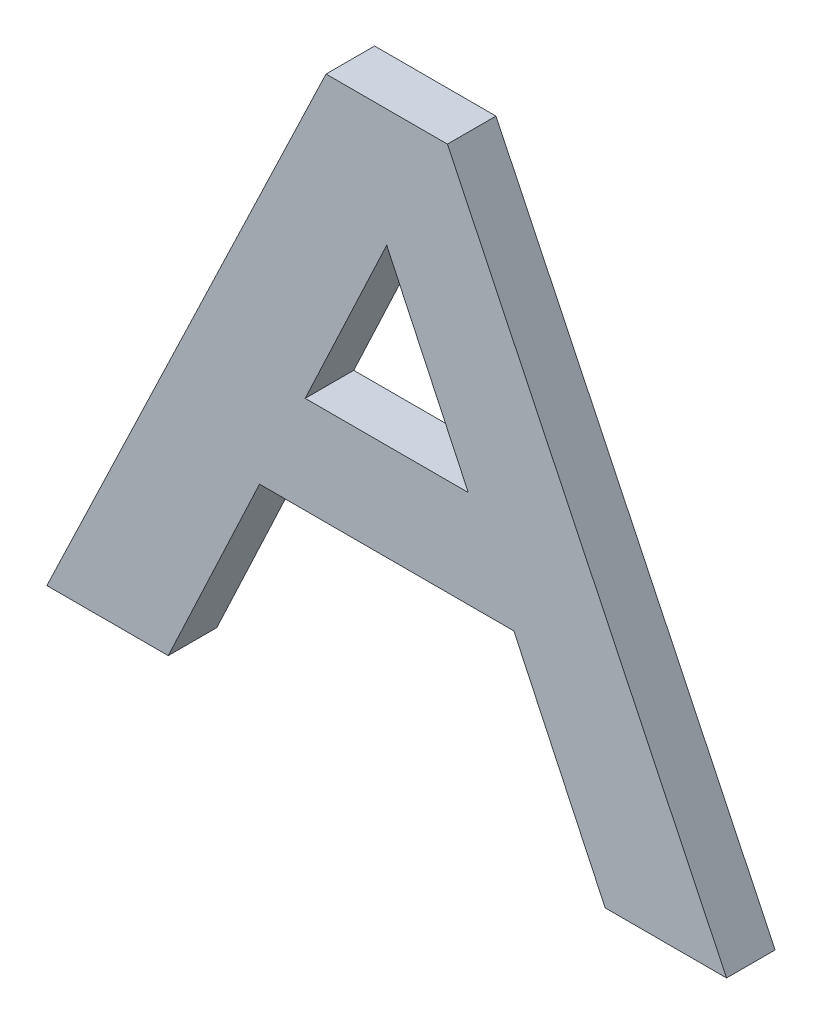
ISO-10303-21;
HEADER;
FILE_DESCRIPTION(('STEP AP214'),'2;1');
FILE_NAME('part.step','',(''),(''),'','','');
FILE_SCHEMA(('AUTOMOTIVE_DESIGN { 1 0 10303 214 1 1 1 1 }'));
ENDSEC;
DATA;
#1=APPLICATION_CONTEXT('core data for automotive mechanical design processes');
#2=APPLICATION_PROTOCOL_DEFINITION('international standard','automotive_design',2000,#1);
#3=PRODUCT_CONTEXT('',#1,'mechanical');
#4=PRODUCT('Part','Part','',(#3));
#5=PRODUCT_RELATED_PRODUCT_CATEGORY('part','',(#4));
#6=PRODUCT_DEFINITION_FORMATION('','',#4);
#7=PRODUCT_DEFINITION_CONTEXT('part definition',#1,'design');
#8=PRODUCT_DEFINITION('design','',#6,#7);
#9=PRODUCT_DEFINITION_SHAPE('','',#8);
#10=(LENGTH_UNIT() NAMED_UNIT(*) SI_UNIT(.MILLI.,.METRE.));
#11=(NAMED_UNIT(*) PLANE_ANGLE_UNIT() SI_UNIT($,.RADIAN.));
#12=(NAMED_UNIT(*) SI_UNIT($,.STERADIAN.) SOLID_ANGLE_UNIT());
#13=UNCERTAINTY_MEASURE_WITH_UNIT(LENGTH_MEASURE(1.E-05),#10,'distance_accuracy_value','');
#14=(GEOMETRIC_REPRESENTATION_CONTEXT(3) GLOBAL_UNCERTAINTY_ASSIGNED_CONTEXT((#13)) GLOBAL_UNIT_ASSIGNED_CONTEXT((#10,
#11,#12)) REPRESENTATION_CONTEXT('',''));
#15=CARTESIAN_POINT('',(0.,0.,0.));
#16=DIRECTION('',(0.,0.,1.));
#17=DIRECTION('',(1.,0.,0.));
#18=AXIS2_PLACEMENT_3D('',#15,#16,#17);
#19=CARTESIAN_POINT('',(36.1499470525944,17.3218496293682,6.35));
#20=DIRECTION('',(0.901816028724632,0.432120180430554,0.));
#21=DIRECTION('',(-0.432120180430554,0.901816028724632,0.));
#22=AXIS2_PLACEMENT_3D('',#19,#20,#21);
#23=PLANE('',#22);
#24=DIRECTION('',(0.432120180430554,-0.901816028724632,0.));
#25=VECTOR('',#24,1.);
#26=CARTESIAN_POINT('',(36.1499470525944,17.3218496293682,0.));
#27=LINE('',#26,#25);
#28=CARTESIAN_POINT('',(7.9375,76.1999999999999,0.));
#29=VERTEX_POINT('',#28);
#30=CARTESIAN_POINT('',(44.45,0.,0.));
#31=VERTEX_POINT('',#30);
#32=EDGE_CURVE('E166',#29,#31,#27,.T.);
#33=ORIENTED_EDGE('',*,*,#32,.F.);
#34=DIRECTION('',(0.,0.,-1.));
#35=VECTOR('',#34,1.);
#36=CARTESIAN_POINT('',(7.9375,76.1999999999999,6.35));
#37=LINE('',#36,#35);
#38=CARTESIAN_POINT('',(7.9375,76.1999999999999,6.35));
#39=VERTEX_POINT('',#38);
#40=EDGE_CURVE('E11',#39,#29,#37,.T.);
#41=ORIENTED_EDGE('',*,*,#40,.F.);
#42=DIRECTION('',(0.432120180430554,-0.901816028724632,0.));
#43=VECTOR('',#42,1.);
#44=CARTESIAN_POINT('',(36.1499470525944,17.3218496293682,6.35));
#45=LINE('',#44,#43);
#46=CARTESIAN_POINT('',(44.45,0.,6.35));
#47=VERTEX_POINT('',#46);
#48=EDGE_CURVE('E218',#39,#47,#45,.T.);
#49=ORIENTED_EDGE('',*,*,#48,.T.);
#50=DIRECTION('',(0.,0.,-1.));
#51=VECTOR('',#50,1.);
#52=CARTESIAN_POINT('',(44.45,0.,6.35));
#53=LINE('',#52,#51);
#54=EDGE_CURVE('E58',#47,#31,#53,.T.);
#55=ORIENTED_EDGE('',*,*,#54,.T.);
#56=EDGE_LOOP('',(#33,#41,#49,#55));
#57=FACE_BOUND('',#56,.T.);
#58=ADVANCED_FACE('F39',(#57),#23,.T.);
#59=CARTESIAN_POINT('',(0.,76.1999999999999,6.35));
#60=DIRECTION('',(0.,1.,0.));
#61=DIRECTION('',(0.,0.,1.));
#62=AXIS2_PLACEMENT_3D('',#59,#60,#61);
#63=PLANE('',#62);
#64=DIRECTION('',(1.,0.,0.));
#65=VECTOR('',#64,1.);
#66=CARTESIAN_POINT('',(0.,76.1999999999999,0.));
#67=LINE('',#66,#65);
#68=CARTESIAN_POINT('',(-7.9375,76.1999999999999,0.));
#69=VERTEX_POINT('',#68);
#70=EDGE_CURVE('E168',#69,#29,#67,.T.);
#71=ORIENTED_EDGE('',*,*,#70,.F.);
#72=DIRECTION('',(0.,0.,-1.));
#73=VECTOR('',#72,1.);
#74=CARTESIAN_POINT('',(-7.9375,76.1999999999999,6.35));
#75=LINE('',#74,#73);
#76=CARTESIAN_POINT('',(-7.9375,76.1999999999999,6.35));
#77=VERTEX_POINT('',#76);
#78=EDGE_CURVE('E49',#77,#69,#75,.T.);
#79=ORIENTED_EDGE('',*,*,#78,.F.);
#80=DIRECTION('',(1.,0.,0.));
#81=VECTOR('',#80,1.);
#82=CARTESIAN_POINT('',(0.,76.1999999999999,6.35));
#83=LINE('',#82,#81);
#84=EDGE_CURVE('E220',#77,#39,#83,.T.);
#85=ORIENTED_EDGE('',*,*,#84,.T.);
#86=ORIENTED_EDGE('',*,*,#40,.T.);
#87=EDGE_LOOP('',(#71,#79,#85,#86));
#88=FACE_BOUND('',#87,.T.);
#89=ADVANCED_FACE('F248',(#88),#63,.T.);
#90=CARTESIAN_POINT('',(-36.1499470525944,17.3218496293682,6.35));
#91=DIRECTION('',(0.901816028724632,-0.432120180430554,0.));
#92=DIRECTION('',(0.432120180430554,0.901816028724632,0.));
#93=AXIS2_PLACEMENT_3D('',#90,#91,#92);
#94=PLANE('',#93);
#95=DIRECTION('',(-0.432120180430554,-0.901816028724632,0.));
#96=VECTOR('',#95,1.);
#97=CARTESIAN_POINT('',(-36.1499470525944,17.3218496293682,0.));
#98=LINE('',#97,#96);
#99=CARTESIAN_POINT('',(-44.45,0.,0.));
#100=VERTEX_POINT('',#99);
#101=EDGE_CURVE('E171',#69,#100,#98,.T.);
#102=ORIENTED_EDGE('',*,*,#101,.T.);
#103=DIRECTION('',(0.,0.,-1.));
#104=VECTOR('',#103,1.);
#105=CARTESIAN_POINT('',(-44.45,0.,6.35));
#106=LINE('',#105,#104);
#107=CARTESIAN_POINT('',(-44.45,0.,6.35));
#108=VERTEX_POINT('',#107);
#109=EDGE_CURVE('E192',#108,#100,#106,.T.);
#110=ORIENTED_EDGE('',*,*,#109,.F.);
#111=DIRECTION('',(-0.432120180430554,-0.901816028724632,0.));
#112=VECTOR('',#111,1.);
#113=CARTESIAN_POINT('',(-36.1499470525944,17.3218496293682,6.35));
#114=LINE('',#113,#112);
#115=EDGE_CURVE('E223',#77,#108,#114,.T.);
#116=ORIENTED_EDGE('',*,*,#115,.F.);
#117=ORIENTED_EDGE('',*,*,#78,.T.);
#118=EDGE_LOOP('',(#102,#110,#116,#117));
#119=FACE_BOUND('',#118,.T.);
#120=ADVANCED_FACE('F253',(#119),#94,.F.);
#121=CARTESIAN_POINT('',(0.,0.,6.35));
#122=DIRECTION('',(0.,1.,0.));
#123=DIRECTION('',(-1.,0.,0.));
#124=AXIS2_PLACEMENT_3D('',#121,#122,#123);
#125=PLANE('',#124);
#126=DIRECTION('',(1.,0.,0.));
#127=VECTOR('',#126,1.);
#128=CARTESIAN_POINT('',(0.,0.,0.));
#129=LINE('',#128,#127);
#130=CARTESIAN_POINT('',(-28.575,0.,0.));
#131=VERTEX_POINT('',#130);
#132=EDGE_CURVE('E174',#100,#131,#129,.T.);
#133=ORIENTED_EDGE('',*,*,#132,.T.);
#134=DIRECTION('',(0.,0.,-1.));
#135=VECTOR('',#134,1.);
#136=CARTESIAN_POINT('',(-28.575,0.,6.35));
#137=LINE('',#136,#135);
#138=CARTESIAN_POINT('',(-28.575,0.,6.35));
#139=VERTEX_POINT('',#138);
#140=EDGE_CURVE('E189',#139,#131,#137,.T.);
#141=ORIENTED_EDGE('',*,*,#140,.F.);
#142=DIRECTION('',(1.,0.,0.));
#143=VECTOR('',#142,1.);
#144=CARTESIAN_POINT('',(0.,0.,6.35));
#145=LINE('',#144,#143);
#146=EDGE_CURVE('E226',#108,#139,#145,.T.);
#147=ORIENTED_EDGE('',*,*,#146,.F.);
#148=ORIENTED_EDGE('',*,*,#109,.T.);
#149=EDGE_LOOP('',(#133,#141,#147,#148));
#150=FACE_BOUND('',#149,.T.);
#151=ADVANCED_FACE('F232',(#150),#125,.F.);
#152=CARTESIAN_POINT('',(-23.4031398800721,11.0017164945675,6.35));
#153=DIRECTION('',(-0.904990342413962,0.425432109904106,0.));
#154=DIRECTION('',(-0.425432109904106,-0.904990342413962,0.));
#155=AXIS2_PLACEMENT_3D('',#152,#153,#154);
#156=PLANE('',#155);
#157=DIRECTION('',(0.425432109904106,0.904990342413962,0.));
#158=VECTOR('',#157,1.);
#159=CARTESIAN_POINT('',(-23.4031398800721,11.0017164945675,0.));
#160=LINE('',#159,#158);
#161=CARTESIAN_POINT('',(-16.6345680582176,25.3999999999999,0.));
#162=VERTEX_POINT('',#161);
#163=EDGE_CURVE('E177',#131,#162,#160,.T.);
#164=ORIENTED_EDGE('',*,*,#163,.T.);
#165=DIRECTION('',(0.,0.,-1.));
#166=VECTOR('',#165,1.);
#167=CARTESIAN_POINT('',(-16.6345680582176,25.3999999999999,6.35));
#168=LINE('',#167,#166);
#169=CARTESIAN_POINT('',(-16.6345680582176,25.3999999999999,6.35));
#170=VERTEX_POINT('',#169);
#171=EDGE_CURVE('E149',#170,#162,#168,.T.);
#172=ORIENTED_EDGE('',*,*,#171,.F.);
#173=DIRECTION('',(0.425432109904106,0.904990342413962,0.));
#174=VECTOR('',#173,1.);
#175=CARTESIAN_POINT('',(-23.4031398800721,11.0017164945675,6.35));
#176=LINE('',#175,#174);
#177=EDGE_CURVE('E138',#139,#170,#176,.T.);
#178=ORIENTED_EDGE('',*,*,#177,.F.);
#179=ORIENTED_EDGE('',*,*,#140,.T.);
#180=EDGE_LOOP('',(#164,#172,#178,#179));
#181=FACE_BOUND('',#180,.T.);
#182=ADVANCED_FACE('F234',(#181),#156,.F.);
#183=CARTESIAN_POINT('',(0.,25.3999999999999,6.35));
#184=DIRECTION('',(0.,1.,0.));
#185=DIRECTION('',(0.,0.,1.));
#186=AXIS2_PLACEMENT_3D('',#183,#184,#185);
#187=PLANE('',#186);
#188=DIRECTION('',(1.,0.,0.));
#189=VECTOR('',#188,1.);
#190=CARTESIAN_POINT('',(0.,25.3999999999999,0.));
#191=LINE('',#190,#189);
#192=CARTESIAN_POINT('',(16.6345680582176,25.3999999999999,0.));
#193=VERTEX_POINT('',#192);
#194=EDGE_CURVE('E146',#162,#193,#191,.T.);
#195=ORIENTED_EDGE('',*,*,#194,.T.);
#196=DIRECTION('',(0.,0.,-1.));
#197=VECTOR('',#196,1.);
#198=CARTESIAN_POINT('',(16.6345680582176,25.3999999999999,6.35));
#199=LINE('',#198,#197);
#200=CARTESIAN_POINT('',(16.6345680582176,25.3999999999999,6.35));
#201=VERTEX_POINT('',#200);
#202=EDGE_CURVE('E144',#201,#193,#199,.T.);
#203=ORIENTED_EDGE('',*,*,#202,.F.);
#204=DIRECTION('',(1.,0.,0.));
#205=VECTOR('',#204,1.);
#206=CARTESIAN_POINT('',(0.,25.3999999999999,6.35));
#207=LINE('',#206,#205);
#208=EDGE_CURVE('E130',#170,#201,#207,.T.);
#209=ORIENTED_EDGE('',*,*,#208,.F.);
#210=ORIENTED_EDGE('',*,*,#171,.T.);
#211=EDGE_LOOP('',(#195,#203,#209,#210));
#212=FACE_BOUND('',#211,.T.);
#213=ADVANCED_FACE('F145',(#212),#187,.F.);
#214=CARTESIAN_POINT('',(23.4031398800721,11.0017164945675,6.35));
#215=DIRECTION('',(-0.904990342413962,-0.425432109904106,0.));
#216=DIRECTION('',(0.425432109904106,-0.904990342413962,0.));
#217=AXIS2_PLACEMENT_3D('',#214,#215,#216);
#218=PLANE('',#217);
#219=DIRECTION('',(-0.425432109904106,0.904990342413962,0.));
#220=VECTOR('',#219,1.);
#221=CARTESIAN_POINT('',(23.4031398800721,11.0017164945675,0.));
#222=LINE('',#221,#220);
#223=CARTESIAN_POINT('',(28.575,0.,0.));
#224=VERTEX_POINT('',#223);
#225=EDGE_CURVE('E181',#224,#193,#222,.T.);
#226=ORIENTED_EDGE('',*,*,#225,.F.);
#227=DIRECTION('',(0.,0.,-1.));
#228=VECTOR('',#227,1.);
#229=CARTESIAN_POINT('',(28.575,0.,6.35));
#230=LINE('',#229,#228);
#231=CARTESIAN_POINT('',(28.575,0.,6.35));
#232=VERTEX_POINT('',#231);
#233=EDGE_CURVE('E92',#232,#224,#230,.T.);
#234=ORIENTED_EDGE('',*,*,#233,.F.);
#235=DIRECTION('',(-0.425432109904106,0.904990342413962,0.));
#236=VECTOR('',#235,1.);
#237=CARTESIAN_POINT('',(23.4031398800721,11.0017164945675,6.35));
#238=LINE('',#237,#236);
#239=EDGE_CURVE('E136',#232,#201,#238,.T.);
#240=ORIENTED_EDGE('',*,*,#239,.T.);
#241=ORIENTED_EDGE('',*,*,#202,.T.);
#242=EDGE_LOOP('',(#226,#234,#240,#241));
#243=FACE_BOUND('',#242,.T.);
#244=ADVANCED_FACE('F151',(#243),#218,.T.);
#245=CARTESIAN_POINT('',(-23.4031398800721,11.0017164945675,6.35));
#246=DIRECTION('',(-0.904990342413962,0.425432109904106,0.));
#247=DIRECTION('',(-0.425432109904106,-0.904990342413962,0.));
#248=AXIS2_PLACEMENT_3D('',#245,#246,#247);
#249=PLANE('',#248);
#250=DIRECTION('',(0.425432109904106,0.904990342413962,0.));
#251=VECTOR('',#250,1.);
#252=CARTESIAN_POINT('',(-23.4031398800721,11.0017164945675,0.));
#253=LINE('',#252,#251);
#254=CARTESIAN_POINT('',(-10.6643520873264,38.0999999999999,0.));
#255=VERTEX_POINT('',#254);
#256=CARTESIAN_POINT('',(0.,60.7854894646009,0.));
#257=VERTEX_POINT('',#256);
#258=EDGE_CURVE('E158',#255,#257,#253,.T.);
#259=ORIENTED_EDGE('',*,*,#258,.T.);
#260=DIRECTION('',(0.,0.,-1.));
#261=VECTOR('',#260,1.);
#262=CARTESIAN_POINT('',(0.,60.7854894646009,6.35));
#263=LINE('',#262,#261);
#264=CARTESIAN_POINT('',(0.,60.7854894646009,6.35));
#265=VERTEX_POINT('',#264);
#266=EDGE_CURVE('E43',#265,#257,#263,.T.);
#267=ORIENTED_EDGE('',*,*,#266,.F.);
#268=DIRECTION('',(0.425432109904106,0.904990342413962,0.));
#269=VECTOR('',#268,1.);
#270=CARTESIAN_POINT('',(-23.4031398800721,11.0017164945675,6.35));
#271=LINE('',#270,#269);
#272=CARTESIAN_POINT('',(-10.6643520873264,38.0999999999999,6.35));
#273=VERTEX_POINT('',#272);
#274=EDGE_CURVE('E105',#273,#265,#271,.T.);
#275=ORIENTED_EDGE('',*,*,#274,.F.);
#276=DIRECTION('',(0.,0.,-1.));
#277=VECTOR('',#276,1.);
#278=CARTESIAN_POINT('',(-10.6643520873264,38.0999999999999,6.35));
#279=LINE('',#278,#277);
#280=EDGE_CURVE('E154',#273,#255,#279,.T.);
#281=ORIENTED_EDGE('',*,*,#280,.T.);
#282=EDGE_LOOP('',(#259,#267,#275,#281));
#283=FACE_BOUND('',#282,.T.);
#284=ADVANCED_FACE('F41',(#283),#249,.F.);
#285=CARTESIAN_POINT('',(23.4031398800721,11.0017164945675,6.35));
#286=DIRECTION('',(-0.904990342413962,-0.425432109904106,0.));
#287=DIRECTION('',(0.425432109904106,-0.904990342413962,0.));
#288=AXIS2_PLACEMENT_3D('',#285,#286,#287);
#289=PLANE('',#288);
#290=DIRECTION('',(-0.425432109904106,0.904990342413962,0.));
#291=VECTOR('',#290,1.);
#292=CARTESIAN_POINT('',(23.4031398800721,11.0017164945675,0.));
#293=LINE('',#292,#291);
#294=CARTESIAN_POINT('',(10.6643520873264,38.0999999999999,0.));
#295=VERTEX_POINT('',#294);
#296=EDGE_CURVE('E161',#295,#257,#293,.T.);
#297=ORIENTED_EDGE('',*,*,#296,.F.);
#298=DIRECTION('',(0.,0.,-1.));
#299=VECTOR('',#298,1.);
#300=CARTESIAN_POINT('',(10.6643520873264,38.0999999999999,6.35));
#301=LINE('',#300,#299);
#302=CARTESIAN_POINT('',(10.6643520873264,38.0999999999999,6.35));
#303=VERTEX_POINT('',#302);
#304=EDGE_CURVE('E197',#303,#295,#301,.T.);
#305=ORIENTED_EDGE('',*,*,#304,.F.);
#306=DIRECTION('',(-0.425432109904106,0.904990342413962,0.));
#307=VECTOR('',#306,1.);
#308=CARTESIAN_POINT('',(23.4031398800721,11.0017164945675,6.35));
#309=LINE('',#308,#307);
#310=EDGE_CURVE('E205',#303,#265,#309,.T.);
#311=ORIENTED_EDGE('',*,*,#310,.T.);
#312=ORIENTED_EDGE('',*,*,#266,.T.);
#313=EDGE_LOOP('',(#297,#305,#311,#312));
#314=FACE_BOUND('',#313,.T.);
#315=ADVANCED_FACE('F204',(#314),#289,.T.);
#316=CARTESIAN_POINT('',(0.,38.0999999999999,6.35));
#317=DIRECTION('',(0.,-1.,0.));
#318=DIRECTION('',(0.,0.,-1.));
#319=AXIS2_PLACEMENT_3D('',#316,#317,#318);
#320=PLANE('',#319);
#321=DIRECTION('',(-1.,0.,0.));
#322=VECTOR('',#321,1.);
#323=CARTESIAN_POINT('',(0.,38.0999999999999,0.));
#324=LINE('',#323,#322);
#325=EDGE_CURVE('E164',#295,#255,#324,.T.);
#326=ORIENTED_EDGE('',*,*,#325,.T.);
#327=ORIENTED_EDGE('',*,*,#280,.F.);
#328=DIRECTION('',(-1.,0.,0.));
#329=VECTOR('',#328,1.);
#330=CARTESIAN_POINT('',(0.,38.0999999999999,6.35));
#331=LINE('',#330,#329);
#332=EDGE_CURVE('E213',#303,#273,#331,.T.);
#333=ORIENTED_EDGE('',*,*,#332,.F.);
#334=ORIENTED_EDGE('',*,*,#304,.T.);
#335=EDGE_LOOP('',(#326,#327,#333,#334));
#336=FACE_BOUND('',#335,.T.);
#337=ADVANCED_FACE('F212',(#336),#320,.F.);
#338=CARTESIAN_POINT('',(0.,0.,6.35));
#339=DIRECTION('',(0.,-1.,0.));
#340=DIRECTION('',(1.,0.,0.));
#341=AXIS2_PLACEMENT_3D('',#338,#339,#340);
#342=PLANE('',#341);
#343=DIRECTION('',(-1.,0.,0.));
#344=VECTOR('',#343,1.);
#345=CARTESIAN_POINT('',(0.,0.,0.));
#346=LINE('',#345,#344);
#347=EDGE_CURVE('E183',#31,#224,#346,.T.);
#348=ORIENTED_EDGE('',*,*,#347,.F.);
#349=ORIENTED_EDGE('',*,*,#54,.F.);
#350=DIRECTION('',(-1.,0.,0.));
#351=VECTOR('',#350,1.);
#352=CARTESIAN_POINT('',(0.,0.,6.35));
#353=LINE('',#352,#351);
#354=EDGE_CURVE('E152',#47,#232,#353,.T.);
#355=ORIENTED_EDGE('',*,*,#354,.T.);
#356=ORIENTED_EDGE('',*,*,#233,.T.);
#357=EDGE_LOOP('',(#348,#349,#355,#356));
#358=FACE_BOUND('',#357,.T.);
#359=ADVANCED_FACE('F236',(#358),#342,.T.);
#360=CARTESIAN_POINT('',(0.,0.,6.35));
#361=DIRECTION('',(0.,0.,1.));
#362=DIRECTION('',(1.,0.,0.));
#363=AXIS2_PLACEMENT_3D('',#360,#361,#362);
#364=PLANE('',#363);
#365=ORIENTED_EDGE('',*,*,#274,.T.);
#366=ORIENTED_EDGE('',*,*,#310,.F.);
#367=ORIENTED_EDGE('',*,*,#332,.T.);
#368=EDGE_LOOP('',(#365,#366,#367));
#369=FACE_BOUND('',#368,.T.);
#370=ORIENTED_EDGE('',*,*,#48,.F.);
#371=ORIENTED_EDGE('',*,*,#84,.F.);
#372=ORIENTED_EDGE('',*,*,#115,.T.);
#373=ORIENTED_EDGE('',*,*,#146,.T.);
#374=ORIENTED_EDGE('',*,*,#177,.T.);
#375=ORIENTED_EDGE('',*,*,#208,.T.);
#376=ORIENTED_EDGE('',*,*,#239,.F.);
#377=ORIENTED_EDGE('',*,*,#354,.F.);
#378=EDGE_LOOP('',(#370,#371,#372,#373,#374,#375,#376,#377));
#379=FACE_BOUND('',#378,.T.);
#380=ADVANCED_FACE('F133',(#369,#379),#364,.T.);
#381=CARTESIAN_POINT('',(0.,0.,0.));
#382=DIRECTION('',(0.,0.,1.));
#383=DIRECTION('',(1.,0.,0.));
#384=AXIS2_PLACEMENT_3D('',#381,#382,#383);
#385=PLANE('',#384);
#386=ORIENTED_EDGE('',*,*,#258,.F.);
#387=ORIENTED_EDGE('',*,*,#325,.F.);
#388=ORIENTED_EDGE('',*,*,#296,.T.);
#389=EDGE_LOOP('',(#386,#387,#388));
#390=FACE_BOUND('',#389,.T.);
#391=ORIENTED_EDGE('',*,*,#32,.T.);
#392=ORIENTED_EDGE('',*,*,#347,.T.);
#393=ORIENTED_EDGE('',*,*,#225,.T.);
#394=ORIENTED_EDGE('',*,*,#194,.F.);
#395=ORIENTED_EDGE('',*,*,#163,.F.);
#396=ORIENTED_EDGE('',*,*,#132,.F.);
#397=ORIENTED_EDGE('',*,*,#101,.F.);
#398=ORIENTED_EDGE('',*,*,#70,.T.);
#399=EDGE_LOOP('',(#391,#392,#393,#394,#395,#396,#397,#398));
#400=FACE_BOUND('',#399,.T.);
#401=ADVANCED_FACE('F210',(#390,#400),#385,.F.);
#402=CLOSED_SHELL('',(#58,#89,#120,#151,#182,#213,#244,#284,#315,#337,#359,#380,#401));
#403=MANIFOLD_SOLID_BREP('B2',#402);
#404=ADVANCED_BREP_SHAPE_REPRESENTATION('',(#18,#403),#14);
#405=SHAPE_DEFINITION_REPRESENTATION(#9,#404);
ENDSEC;
END-ISO-10303-21;
